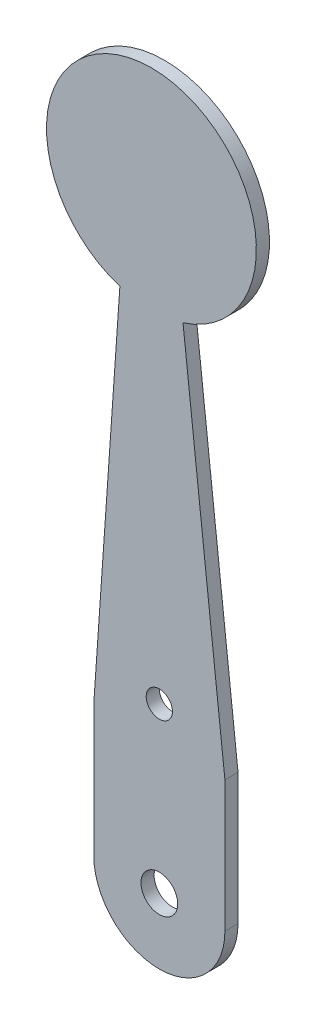
ISO-10303-21;
HEADER;
FILE_DESCRIPTION(('STEP AP214'),'2;1');
FILE_NAME('part.step','',(''),(''),'','','');
FILE_SCHEMA(('AUTOMOTIVE_DESIGN { 1 0 10303 214 1 1 1 1 }'));
ENDSEC;
DATA;
#1=APPLICATION_CONTEXT('core data for automotive mechanical design processes');
#2=APPLICATION_PROTOCOL_DEFINITION('international standard','automotive_design',2000,#1);
#3=PRODUCT_CONTEXT('',#1,'mechanical');
#4=PRODUCT('Part','Part','',(#3));
#5=PRODUCT_RELATED_PRODUCT_CATEGORY('part','',(#4));
#6=PRODUCT_DEFINITION_FORMATION('','',#4);
#7=PRODUCT_DEFINITION_CONTEXT('part definition',#1,'design');
#8=PRODUCT_DEFINITION('design','',#6,#7);
#9=PRODUCT_DEFINITION_SHAPE('','',#8);
#10=(LENGTH_UNIT() NAMED_UNIT(*) SI_UNIT(.MILLI.,.METRE.));
#11=(NAMED_UNIT(*) PLANE_ANGLE_UNIT() SI_UNIT($,.RADIAN.));
#12=(NAMED_UNIT(*) SI_UNIT($,.STERADIAN.) SOLID_ANGLE_UNIT());
#13=UNCERTAINTY_MEASURE_WITH_UNIT(LENGTH_MEASURE(1.E-05),#10,'distance_accuracy_value','');
#14=(GEOMETRIC_REPRESENTATION_CONTEXT(3) GLOBAL_UNCERTAINTY_ASSIGNED_CONTEXT((#13)) GLOBAL_UNIT_ASSIGNED_CONTEXT((#10,
#11,#12)) REPRESENTATION_CONTEXT('',''));
#15=CARTESIAN_POINT('',(0.,0.,0.));
#16=DIRECTION('',(0.,0.,1.));
#17=DIRECTION('',(1.,0.,0.));
#18=AXIS2_PLACEMENT_3D('',#15,#16,#17);
#19=CARTESIAN_POINT('',(45.2059903999995,-15.7615616000238,-1.));
#20=DIRECTION('',(0.,0.,1.));
#21=DIRECTION('',(1.,0.,0.));
#22=AXIS2_PLACEMENT_3D('',#19,#20,#21);
#23=CYLINDRICAL_SURFACE('',#22,5.);
#24=CARTESIAN_POINT('',(45.2059903999995,-15.7615616000238,0.));
#25=DIRECTION('',(0.,0.,1.));
#26=DIRECTION('',(1.,0.,0.));
#27=AXIS2_PLACEMENT_3D('',#24,#25,#26);
#28=CIRCLE('',#27,5.);
#29=CARTESIAN_POINT('',(40.2059903999995,-15.7615616000238,0.));
#30=VERTEX_POINT('',#29);
#31=CARTESIAN_POINT('',(50.2059903999995,-15.7615616000238,0.));
#32=VERTEX_POINT('',#31);
#33=EDGE_CURVE('E123',#30,#32,#28,.T.);
#34=ORIENTED_EDGE('',*,*,#33,.F.);
#35=DIRECTION('',(0.,0.,1.));
#36=VECTOR('',#35,1.);
#37=CARTESIAN_POINT('',(40.2059903999995,-15.7615616000238,-1.));
#38=LINE('',#37,#36);
#39=CARTESIAN_POINT('',(40.2059903999995,-15.7615616000238,-1.));
#40=VERTEX_POINT('',#39);
#41=EDGE_CURVE('E11',#40,#30,#38,.T.);
#42=ORIENTED_EDGE('',*,*,#41,.F.);
#43=CARTESIAN_POINT('',(45.2059903999995,-15.7615616000238,-1.));
#44=DIRECTION('',(0.,0.,1.));
#45=DIRECTION('',(1.,0.,0.));
#46=AXIS2_PLACEMENT_3D('',#43,#44,#45);
#47=CIRCLE('',#46,5.);
#48=CARTESIAN_POINT('',(50.2059903999995,-15.7615616000238,-1.));
#49=VERTEX_POINT('',#48);
#50=EDGE_CURVE('E138',#40,#49,#47,.T.);
#51=ORIENTED_EDGE('',*,*,#50,.T.);
#52=DIRECTION('',(0.,0.,1.));
#53=VECTOR('',#52,1.);
#54=CARTESIAN_POINT('',(50.2059903999995,-15.7615616000238,-1.));
#55=LINE('',#54,#53);
#56=EDGE_CURVE('E41',#49,#32,#55,.T.);
#57=ORIENTED_EDGE('',*,*,#56,.T.);
#58=EDGE_LOOP('',(#34,#42,#51,#57));
#59=FACE_BOUND('',#58,.T.);
#60=ADVANCED_FACE('F38',(#59),#23,.T.);
#61=CARTESIAN_POINT('',(40.2059903999995,-5.76156160002383,-1.));
#62=DIRECTION('',(-1.,0.,0.));
#63=DIRECTION('',(0.,-1.,0.));
#64=AXIS2_PLACEMENT_3D('',#61,#62,#63);
#65=PLANE('',#64);
#66=DIRECTION('',(0.,-1.,0.));
#67=VECTOR('',#66,1.);
#68=CARTESIAN_POINT('',(40.2059903999995,-5.76156160002383,0.));
#69=LINE('',#68,#67);
#70=CARTESIAN_POINT('',(40.2059903999995,-5.76156160002383,0.));
#71=VERTEX_POINT('',#70);
#72=EDGE_CURVE('E136',#71,#30,#69,.T.);
#73=ORIENTED_EDGE('',*,*,#72,.F.);
#74=DIRECTION('',(0.,0.,1.));
#75=VECTOR('',#74,1.);
#76=CARTESIAN_POINT('',(40.2059903999995,-5.76156160002383,-1.));
#77=LINE('',#76,#75);
#78=CARTESIAN_POINT('',(40.2059903999995,-5.76156160002383,-1.));
#79=VERTEX_POINT('',#78);
#80=EDGE_CURVE('E47',#79,#71,#77,.T.);
#81=ORIENTED_EDGE('',*,*,#80,.F.);
#82=DIRECTION('',(0.,-1.,0.));
#83=VECTOR('',#82,1.);
#84=CARTESIAN_POINT('',(40.2059903999995,-5.76156160002383,-1.));
#85=LINE('',#84,#83);
#86=EDGE_CURVE('E113',#79,#40,#85,.T.);
#87=ORIENTED_EDGE('',*,*,#86,.T.);
#88=ORIENTED_EDGE('',*,*,#41,.T.);
#89=EDGE_LOOP('',(#73,#81,#87,#88));
#90=FACE_BOUND('',#89,.T.);
#91=ADVANCED_FACE('F146',(#90),#65,.T.);
#92=CARTESIAN_POINT('',(40.2059903999995,-5.76156160002383,-1.));
#93=DIRECTION('',(-0.997580379345878,0.069522562842112,0.));
#94=DIRECTION('',(-0.069522562842112,-0.997580379345878,0.));
#95=AXIS2_PLACEMENT_3D('',#92,#93,#94);
#96=PLANE('',#95);
#97=DIRECTION('',(-0.069522562842112,-0.997580379345877,0.));
#98=VECTOR('',#97,1.);
#99=CARTESIAN_POINT('',(40.2059903999995,-5.76156160002383,0.));
#100=LINE('',#99,#98);
#101=CARTESIAN_POINT('',(42.1978551382343,22.8197377644226,0.));
#102=VERTEX_POINT('',#101);
#103=EDGE_CURVE('E100',#102,#71,#100,.T.);
#104=ORIENTED_EDGE('',*,*,#103,.F.);
#105=DIRECTION('',(0.,0.,1.));
#106=VECTOR('',#105,1.);
#107=CARTESIAN_POINT('',(42.1978551382343,22.8197377644226,-1.));
#108=LINE('',#107,#106);
#109=CARTESIAN_POINT('',(42.1978551382343,22.8197377644226,-1.));
#110=VERTEX_POINT('',#109);
#111=EDGE_CURVE('E95',#110,#102,#108,.T.);
#112=ORIENTED_EDGE('',*,*,#111,.F.);
#113=DIRECTION('',(-0.069522562842112,-0.997580379345877,0.));
#114=VECTOR('',#113,1.);
#115=CARTESIAN_POINT('',(40.2059903999995,-5.76156160002383,-1.));
#116=LINE('',#115,#114);
#117=EDGE_CURVE('E98',#110,#79,#116,.T.);
#118=ORIENTED_EDGE('',*,*,#117,.T.);
#119=ORIENTED_EDGE('',*,*,#80,.T.);
#120=EDGE_LOOP('',(#104,#112,#118,#119));
#121=FACE_BOUND('',#120,.T.);
#122=ADVANCED_FACE('F97',(#121),#96,.T.);
#123=CARTESIAN_POINT('',(44.6043633476465,30.4492015881806,-1.));
#124=DIRECTION('',(0.,0.,1.));
#125=DIRECTION('',(1.,0.,0.));
#126=AXIS2_PLACEMENT_3D('',#123,#124,#125);
#127=CYLINDRICAL_SURFACE('',#126,8.);
#128=CARTESIAN_POINT('',(44.6043633476465,30.4492015881806,0.));
#129=DIRECTION('',(0.,0.,1.));
#130=DIRECTION('',(-1.,0.,0.));
#131=AXIS2_PLACEMENT_3D('',#128,#129,#130);
#132=CIRCLE('',#131,8.);
#133=CARTESIAN_POINT('',(47.0108715570586,22.8197377644226,0.));
#134=VERTEX_POINT('',#133);
#135=EDGE_CURVE('E133',#134,#102,#132,.T.);
#136=ORIENTED_EDGE('',*,*,#135,.F.);
#137=DIRECTION('',(0.,0.,1.));
#138=VECTOR('',#137,1.);
#139=CARTESIAN_POINT('',(47.0108715570586,22.8197377644226,-1.));
#140=LINE('',#139,#138);
#141=CARTESIAN_POINT('',(47.0108715570586,22.8197377644226,-1.));
#142=VERTEX_POINT('',#141);
#143=EDGE_CURVE('E105',#142,#134,#140,.T.);
#144=ORIENTED_EDGE('',*,*,#143,.F.);
#145=CARTESIAN_POINT('',(44.6043633476465,30.4492015881806,-1.));
#146=DIRECTION('',(0.,0.,1.));
#147=DIRECTION('',(-1.,0.,0.));
#148=AXIS2_PLACEMENT_3D('',#145,#146,#147);
#149=CIRCLE('',#148,8.);
#150=EDGE_CURVE('E111',#142,#110,#149,.T.);
#151=ORIENTED_EDGE('',*,*,#150,.T.);
#152=ORIENTED_EDGE('',*,*,#111,.T.);
#153=EDGE_LOOP('',(#136,#144,#151,#152));
#154=FACE_BOUND('',#153,.T.);
#155=ADVANCED_FACE('F115',(#154),#127,.T.);
#156=CARTESIAN_POINT('',(50.2059903999995,-5.76156160002383,-1.));
#157=DIRECTION('',(0.993809401226692,0.111098487989008,0.));
#158=DIRECTION('',(-0.111098487989008,0.993809401226692,0.));
#159=AXIS2_PLACEMENT_3D('',#156,#157,#158);
#160=PLANE('',#159);
#161=DIRECTION('',(-0.111098487989008,0.993809401226692,0.));
#162=VECTOR('',#161,1.);
#163=CARTESIAN_POINT('',(50.2059903999995,-5.76156160002383,0.));
#164=LINE('',#163,#162);
#165=CARTESIAN_POINT('',(50.2059903999995,-5.76156160002383,0.));
#166=VERTEX_POINT('',#165);
#167=EDGE_CURVE('E130',#166,#134,#164,.T.);
#168=ORIENTED_EDGE('',*,*,#167,.F.);
#169=DIRECTION('',(0.,0.,1.));
#170=VECTOR('',#169,1.);
#171=CARTESIAN_POINT('',(50.2059903999995,-5.76156160002383,-1.));
#172=LINE('',#171,#170);
#173=CARTESIAN_POINT('',(50.2059903999995,-5.76156160002383,-1.));
#174=VERTEX_POINT('',#173);
#175=EDGE_CURVE('E141',#174,#166,#172,.T.);
#176=ORIENTED_EDGE('',*,*,#175,.F.);
#177=DIRECTION('',(-0.111098487989008,0.993809401226692,0.));
#178=VECTOR('',#177,1.);
#179=CARTESIAN_POINT('',(50.2059903999995,-5.76156160002383,-1.));
#180=LINE('',#179,#178);
#181=EDGE_CURVE('E116',#174,#142,#180,.T.);
#182=ORIENTED_EDGE('',*,*,#181,.T.);
#183=ORIENTED_EDGE('',*,*,#143,.T.);
#184=EDGE_LOOP('',(#168,#176,#182,#183));
#185=FACE_BOUND('',#184,.T.);
#186=ADVANCED_FACE('F159',(#185),#160,.T.);
#187=CARTESIAN_POINT('',(50.2059903999995,-5.76156160002383,-1.));
#188=DIRECTION('',(1.,0.,0.));
#189=DIRECTION('',(0.,1.,0.));
#190=AXIS2_PLACEMENT_3D('',#187,#188,#189);
#191=PLANE('',#190);
#192=DIRECTION('',(0.,1.,0.));
#193=VECTOR('',#192,1.);
#194=CARTESIAN_POINT('',(50.2059903999995,-5.76156160002383,0.));
#195=LINE('',#194,#193);
#196=EDGE_CURVE('E126',#32,#166,#195,.T.);
#197=ORIENTED_EDGE('',*,*,#196,.F.);
#198=ORIENTED_EDGE('',*,*,#56,.F.);
#199=DIRECTION('',(0.,1.,0.));
#200=VECTOR('',#199,1.);
#201=CARTESIAN_POINT('',(50.2059903999995,-5.76156160002383,-1.));
#202=LINE('',#201,#200);
#203=EDGE_CURVE('E118',#49,#174,#202,.T.);
#204=ORIENTED_EDGE('',*,*,#203,.T.);
#205=ORIENTED_EDGE('',*,*,#175,.T.);
#206=EDGE_LOOP('',(#197,#198,#204,#205));
#207=FACE_BOUND('',#206,.T.);
#208=ADVANCED_FACE('F143',(#207),#191,.T.);
#209=CARTESIAN_POINT('',(45.2059903999995,-15.7615616000238,-1.));
#210=DIRECTION('',(0.,0.,1.));
#211=DIRECTION('',(1.,0.,0.));
#212=AXIS2_PLACEMENT_3D('',#209,#210,#211);
#213=PLANE('',#212);
#214=CARTESIAN_POINT('',(45.2059903999995,-3.26156160002383,-1.));
#215=DIRECTION('',(0.,0.,1.));
#216=DIRECTION('',(1.,0.,0.));
#217=AXIS2_PLACEMENT_3D('',#214,#215,#216);
#218=CIRCLE('',#217,0.9999999999584);
#219=CARTESIAN_POINT('',(46.2059903999579,-3.26156160002383,-1.));
#220=VERTEX_POINT('',#219);
#221=EDGE_CURVE('E185',#220,#220,#218,.T.);
#222=ORIENTED_EDGE('',*,*,#221,.T.);
#223=EDGE_LOOP('',(#222));
#224=FACE_BOUND('',#223,.T.);
#225=CARTESIAN_POINT('',(45.2059903999995,-15.7615616000238,-1.));
#226=DIRECTION('',(0.,0.,1.));
#227=DIRECTION('',(1.,0.,0.));
#228=AXIS2_PLACEMENT_3D('',#225,#226,#227);
#229=CIRCLE('',#228,1.3999999999584);
#230=CARTESIAN_POINT('',(46.6059903999579,-15.7615616000238,-1.));
#231=VERTEX_POINT('',#230);
#232=EDGE_CURVE('E127',#231,#231,#229,.T.);
#233=ORIENTED_EDGE('',*,*,#232,.T.);
#234=EDGE_LOOP('',(#233));
#235=FACE_BOUND('',#234,.T.);
#236=ORIENTED_EDGE('',*,*,#50,.F.);
#237=ORIENTED_EDGE('',*,*,#86,.F.);
#238=ORIENTED_EDGE('',*,*,#117,.F.);
#239=ORIENTED_EDGE('',*,*,#150,.F.);
#240=ORIENTED_EDGE('',*,*,#181,.F.);
#241=ORIENTED_EDGE('',*,*,#203,.F.);
#242=EDGE_LOOP('',(#236,#237,#238,#239,#240,#241));
#243=FACE_BOUND('',#242,.T.);
#244=ADVANCED_FACE('F109',(#224,#235,#243),#213,.F.);
#245=CARTESIAN_POINT('',(45.2059903999995,-15.7615616000238,0.));
#246=DIRECTION('',(0.,0.,1.));
#247=DIRECTION('',(1.,0.,0.));
#248=AXIS2_PLACEMENT_3D('',#245,#246,#247);
#249=PLANE('',#248);
#250=CARTESIAN_POINT('',(45.2059903999995,-3.26156160002383,0.));
#251=DIRECTION('',(0.,0.,1.));
#252=DIRECTION('',(1.,0.,0.));
#253=AXIS2_PLACEMENT_3D('',#250,#251,#252);
#254=CIRCLE('',#253,0.9999999999584);
#255=CARTESIAN_POINT('',(46.2059903999579,-3.26156160002383,0.));
#256=VERTEX_POINT('',#255);
#257=EDGE_CURVE('E188',#256,#256,#254,.T.);
#258=ORIENTED_EDGE('',*,*,#257,.F.);
#259=EDGE_LOOP('',(#258));
#260=FACE_BOUND('',#259,.T.);
#261=CARTESIAN_POINT('',(45.2059903999995,-15.7615616000238,0.));
#262=DIRECTION('',(0.,0.,1.));
#263=DIRECTION('',(1.,0.,0.));
#264=AXIS2_PLACEMENT_3D('',#261,#262,#263);
#265=CIRCLE('',#264,1.3999999999584);
#266=CARTESIAN_POINT('',(46.6059903999579,-15.7615616000238,0.));
#267=VERTEX_POINT('',#266);
#268=EDGE_CURVE('E190',#267,#267,#265,.T.);
#269=ORIENTED_EDGE('',*,*,#268,.F.);
#270=EDGE_LOOP('',(#269));
#271=FACE_BOUND('',#270,.T.);
#272=ORIENTED_EDGE('',*,*,#33,.T.);
#273=ORIENTED_EDGE('',*,*,#196,.T.);
#274=ORIENTED_EDGE('',*,*,#167,.T.);
#275=ORIENTED_EDGE('',*,*,#135,.T.);
#276=ORIENTED_EDGE('',*,*,#103,.T.);
#277=ORIENTED_EDGE('',*,*,#72,.T.);
#278=EDGE_LOOP('',(#272,#273,#274,#275,#276,#277));
#279=FACE_BOUND('',#278,.T.);
#280=ADVANCED_FACE('F145',(#260,#271,#279),#249,.T.);
#281=CARTESIAN_POINT('',(45.2059903999995,-15.7615616000238,-1.));
#282=DIRECTION('',(0.,0.,1.));
#283=DIRECTION('',(1.,0.,0.));
#284=AXIS2_PLACEMENT_3D('',#281,#282,#283);
#285=CYLINDRICAL_SURFACE('',#284,1.3999999999584);
#286=ORIENTED_EDGE('',*,*,#232,.F.);
#287=EDGE_LOOP('',(#286));
#288=FACE_BOUND('',#287,.T.);
#289=ORIENTED_EDGE('',*,*,#268,.T.);
#290=EDGE_LOOP('',(#289));
#291=FACE_BOUND('',#290,.T.);
#292=ADVANCED_FACE('F170',(#288,#291),#285,.F.);
#293=CARTESIAN_POINT('',(45.2059903999995,-3.26156160002383,-1.));
#294=DIRECTION('',(0.,0.,1.));
#295=DIRECTION('',(1.,0.,0.));
#296=AXIS2_PLACEMENT_3D('',#293,#294,#295);
#297=CYLINDRICAL_SURFACE('',#296,0.9999999999584);
#298=ORIENTED_EDGE('',*,*,#221,.F.);
#299=EDGE_LOOP('',(#298));
#300=FACE_BOUND('',#299,.T.);
#301=ORIENTED_EDGE('',*,*,#257,.T.);
#302=EDGE_LOOP('',(#301));
#303=FACE_BOUND('',#302,.T.);
#304=ADVANCED_FACE('F177',(#300,#303),#297,.F.);
#305=CLOSED_SHELL('',(#60,#91,#122,#155,#186,#208,#244,#280,#292,#304));
#306=MANIFOLD_SOLID_BREP('B2',#305);
#307=ADVANCED_BREP_SHAPE_REPRESENTATION('',(#18,#306),#14);
#308=SHAPE_DEFINITION_REPRESENTATION(#9,#307);
ENDSEC;
END-ISO-10303-21;
